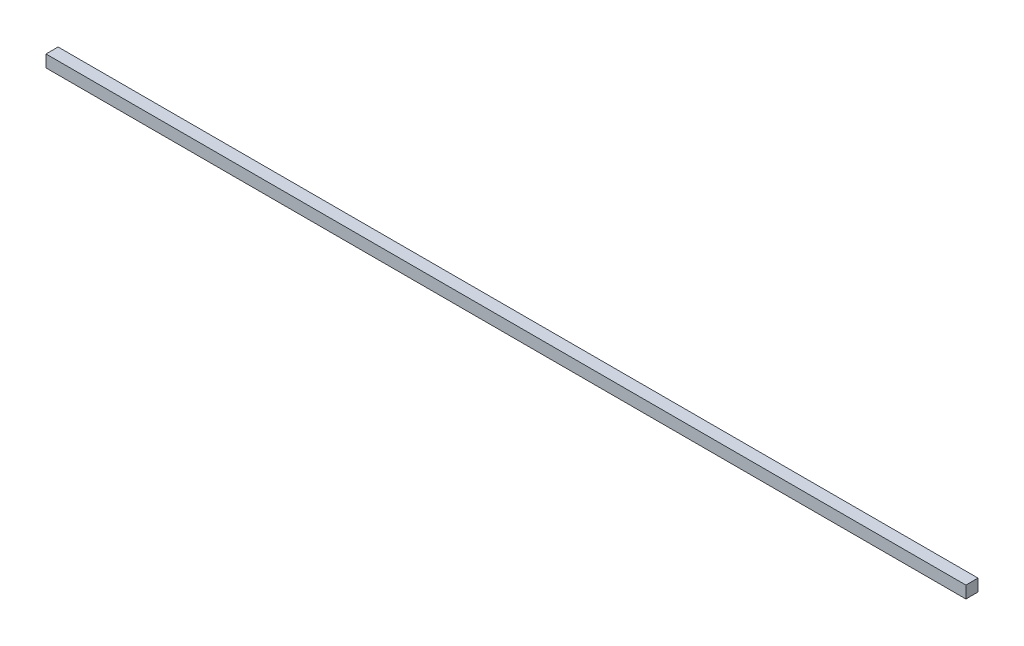
ISO-10303-21;
HEADER;
FILE_DESCRIPTION(('STEP AP214'),'2;1');
FILE_NAME('part.step','',(''),(''),'','','');
FILE_SCHEMA(('AUTOMOTIVE_DESIGN { 1 0 10303 214 1 1 1 1 }'));
ENDSEC;
DATA;
#1=APPLICATION_CONTEXT('core data for automotive mechanical design processes');
#2=APPLICATION_PROTOCOL_DEFINITION('international standard','automotive_design',2000,#1);
#3=PRODUCT_CONTEXT('',#1,'mechanical');
#4=PRODUCT('Part','Part','',(#3));
#5=PRODUCT_RELATED_PRODUCT_CATEGORY('part','',(#4));
#6=PRODUCT_DEFINITION_FORMATION('','',#4);
#7=PRODUCT_DEFINITION_CONTEXT('part definition',#1,'design');
#8=PRODUCT_DEFINITION('design','',#6,#7);
#9=PRODUCT_DEFINITION_SHAPE('','',#8);
#10=(LENGTH_UNIT() NAMED_UNIT(*) SI_UNIT(.MILLI.,.METRE.));
#11=(NAMED_UNIT(*) PLANE_ANGLE_UNIT() SI_UNIT($,.RADIAN.));
#12=(NAMED_UNIT(*) SI_UNIT($,.STERADIAN.) SOLID_ANGLE_UNIT());
#13=UNCERTAINTY_MEASURE_WITH_UNIT(LENGTH_MEASURE(1.E-05),#10,'distance_accuracy_value','');
#14=(GEOMETRIC_REPRESENTATION_CONTEXT(3) GLOBAL_UNCERTAINTY_ASSIGNED_CONTEXT((#13)) GLOBAL_UNIT_ASSIGNED_CONTEXT((#10,
#11,#12)) REPRESENTATION_CONTEXT('',''));
#15=CARTESIAN_POINT('',(0.,0.,0.));
#16=DIRECTION('',(0.,0.,1.));
#17=DIRECTION('',(1.,0.,0.));
#18=AXIS2_PLACEMENT_3D('',#15,#16,#17);
#19=CARTESIAN_POINT('',(-380.,10.,-4.99999999999998));
#20=DIRECTION('',(1.,0.,0.));
#21=DIRECTION('',(0.,0.,-1.));
#22=AXIS2_PLACEMENT_3D('',#19,#20,#21);
#23=PLANE('',#22);
#24=DIRECTION('',(0.,0.,1.));
#25=VECTOR('',#24,1.);
#26=CARTESIAN_POINT('',(-380.,0.,-4.99999999999998));
#27=LINE('',#26,#25);
#28=CARTESIAN_POINT('',(-380.,0.,-4.99999999999998));
#29=VERTEX_POINT('',#28);
#30=CARTESIAN_POINT('',(-380.,0.,5.00000000000002));
#31=VERTEX_POINT('',#30);
#32=EDGE_CURVE('E96',#29,#31,#27,.T.);
#33=ORIENTED_EDGE('',*,*,#32,.T.);
#34=DIRECTION('',(0.,-1.,0.));
#35=VECTOR('',#34,1.);
#36=CARTESIAN_POINT('',(-380.,10.,5.00000000000002));
#37=LINE('',#36,#35);
#38=CARTESIAN_POINT('',(-380.,10.,5.00000000000002));
#39=VERTEX_POINT('',#38);
#40=EDGE_CURVE('E11',#39,#31,#37,.T.);
#41=ORIENTED_EDGE('',*,*,#40,.F.);
#42=DIRECTION('',(0.,0.,1.));
#43=VECTOR('',#42,1.);
#44=CARTESIAN_POINT('',(-380.,10.,-4.99999999999998));
#45=LINE('',#44,#43);
#46=CARTESIAN_POINT('',(-380.,10.,-4.99999999999998));
#47=VERTEX_POINT('',#46);
#48=EDGE_CURVE('E84',#47,#39,#45,.T.);
#49=ORIENTED_EDGE('',*,*,#48,.F.);
#50=DIRECTION('',(0.,-1.,0.));
#51=VECTOR('',#50,1.);
#52=CARTESIAN_POINT('',(-380.,10.,-4.99999999999998));
#53=LINE('',#52,#51);
#54=EDGE_CURVE('E92',#47,#29,#53,.T.);
#55=ORIENTED_EDGE('',*,*,#54,.T.);
#56=EDGE_LOOP('',(#33,#41,#49,#55));
#57=FACE_BOUND('',#56,.T.);
#58=ADVANCED_FACE('F33',(#57),#23,.F.);
#59=CARTESIAN_POINT('',(-380.,10.,5.00000000000002));
#60=DIRECTION('',(0.,0.,-1.));
#61=DIRECTION('',(-1.,0.,0.));
#62=AXIS2_PLACEMENT_3D('',#59,#60,#61);
#63=PLANE('',#62);
#64=DIRECTION('',(1.,0.,0.));
#65=VECTOR('',#64,1.);
#66=CARTESIAN_POINT('',(-380.,0.,5.00000000000002));
#67=LINE('',#66,#65);
#68=CARTESIAN_POINT('',(380.,0.,5.00000000000002));
#69=VERTEX_POINT('',#68);
#70=EDGE_CURVE('E88',#31,#69,#67,.T.);
#71=ORIENTED_EDGE('',*,*,#70,.T.);
#72=DIRECTION('',(0.,-1.,0.));
#73=VECTOR('',#72,1.);
#74=CARTESIAN_POINT('',(380.,10.,5.00000000000002));
#75=LINE('',#74,#73);
#76=CARTESIAN_POINT('',(380.,10.,5.00000000000002));
#77=VERTEX_POINT('',#76);
#78=EDGE_CURVE('E41',#77,#69,#75,.T.);
#79=ORIENTED_EDGE('',*,*,#78,.F.);
#80=DIRECTION('',(1.,0.,0.));
#81=VECTOR('',#80,1.);
#82=CARTESIAN_POINT('',(-380.,10.,5.00000000000002));
#83=LINE('',#82,#81);
#84=EDGE_CURVE('E79',#39,#77,#83,.T.);
#85=ORIENTED_EDGE('',*,*,#84,.F.);
#86=ORIENTED_EDGE('',*,*,#40,.T.);
#87=EDGE_LOOP('',(#71,#79,#85,#86));
#88=FACE_BOUND('',#87,.T.);
#89=ADVANCED_FACE('F87',(#88),#63,.F.);
#90=CARTESIAN_POINT('',(380.,10.,-4.99999999999998));
#91=DIRECTION('',(-1.,0.,0.));
#92=DIRECTION('',(0.,0.,1.));
#93=AXIS2_PLACEMENT_3D('',#90,#91,#92);
#94=PLANE('',#93);
#95=DIRECTION('',(0.,0.,-1.));
#96=VECTOR('',#95,1.);
#97=CARTESIAN_POINT('',(380.,0.,-4.99999999999998));
#98=LINE('',#97,#96);
#99=CARTESIAN_POINT('',(380.,0.,-4.99999999999998));
#100=VERTEX_POINT('',#99);
#101=EDGE_CURVE('E66',#69,#100,#98,.T.);
#102=ORIENTED_EDGE('',*,*,#101,.T.);
#103=DIRECTION('',(0.,-1.,0.));
#104=VECTOR('',#103,1.);
#105=CARTESIAN_POINT('',(380.,10.,-4.99999999999998));
#106=LINE('',#105,#104);
#107=CARTESIAN_POINT('',(380.,10.,-4.99999999999998));
#108=VERTEX_POINT('',#107);
#109=EDGE_CURVE('E89',#108,#100,#106,.T.);
#110=ORIENTED_EDGE('',*,*,#109,.F.);
#111=DIRECTION('',(0.,0.,-1.));
#112=VECTOR('',#111,1.);
#113=CARTESIAN_POINT('',(380.,10.,-4.99999999999998));
#114=LINE('',#113,#112);
#115=EDGE_CURVE('E82',#77,#108,#114,.T.);
#116=ORIENTED_EDGE('',*,*,#115,.F.);
#117=ORIENTED_EDGE('',*,*,#78,.T.);
#118=EDGE_LOOP('',(#102,#110,#116,#117));
#119=FACE_BOUND('',#118,.T.);
#120=ADVANCED_FACE('F90',(#119),#94,.F.);
#121=CARTESIAN_POINT('',(-380.,10.,-4.99999999999998));
#122=DIRECTION('',(0.,0.,1.));
#123=DIRECTION('',(1.,0.,0.));
#124=AXIS2_PLACEMENT_3D('',#121,#122,#123);
#125=PLANE('',#124);
#126=DIRECTION('',(-1.,0.,0.));
#127=VECTOR('',#126,1.);
#128=CARTESIAN_POINT('',(-380.,0.,-4.99999999999998));
#129=LINE('',#128,#127);
#130=EDGE_CURVE('E72',#100,#29,#129,.T.);
#131=ORIENTED_EDGE('',*,*,#130,.T.);
#132=ORIENTED_EDGE('',*,*,#54,.F.);
#133=DIRECTION('',(-1.,0.,0.));
#134=VECTOR('',#133,1.);
#135=CARTESIAN_POINT('',(-380.,10.,-4.99999999999998));
#136=LINE('',#135,#134);
#137=EDGE_CURVE('E49',#108,#47,#136,.T.);
#138=ORIENTED_EDGE('',*,*,#137,.F.);
#139=ORIENTED_EDGE('',*,*,#109,.T.);
#140=EDGE_LOOP('',(#131,#132,#138,#139));
#141=FACE_BOUND('',#140,.T.);
#142=ADVANCED_FACE('F103',(#141),#125,.F.);
#143=CARTESIAN_POINT('',(0.,10.,0.));
#144=DIRECTION('',(0.,1.,0.));
#145=DIRECTION('',(0.,0.,1.));
#146=AXIS2_PLACEMENT_3D('',#143,#144,#145);
#147=PLANE('',#146);
#148=ORIENTED_EDGE('',*,*,#48,.T.);
#149=ORIENTED_EDGE('',*,*,#84,.T.);
#150=ORIENTED_EDGE('',*,*,#115,.T.);
#151=ORIENTED_EDGE('',*,*,#137,.T.);
#152=EDGE_LOOP('',(#148,#149,#150,#151));
#153=FACE_BOUND('',#152,.T.);
#154=ADVANCED_FACE('F80',(#153),#147,.T.);
#155=CARTESIAN_POINT('',(0.,0.,0.));
#156=DIRECTION('',(0.,1.,0.));
#157=DIRECTION('',(0.,0.,1.));
#158=AXIS2_PLACEMENT_3D('',#155,#156,#157);
#159=PLANE('',#158);
#160=ORIENTED_EDGE('',*,*,#32,.F.);
#161=ORIENTED_EDGE('',*,*,#130,.F.);
#162=ORIENTED_EDGE('',*,*,#101,.F.);
#163=ORIENTED_EDGE('',*,*,#70,.F.);
#164=EDGE_LOOP('',(#160,#161,#162,#163));
#165=FACE_BOUND('',#164,.T.);
#166=ADVANCED_FACE('F106',(#165),#159,.F.);
#167=CLOSED_SHELL('',(#58,#89,#120,#142,#154,#166));
#168=MANIFOLD_SOLID_BREP('B2',#167);
#169=ADVANCED_BREP_SHAPE_REPRESENTATION('',(#18,#168),#14);
#170=SHAPE_DEFINITION_REPRESENTATION(#9,#169);
ENDSEC;
END-ISO-10303-21;
